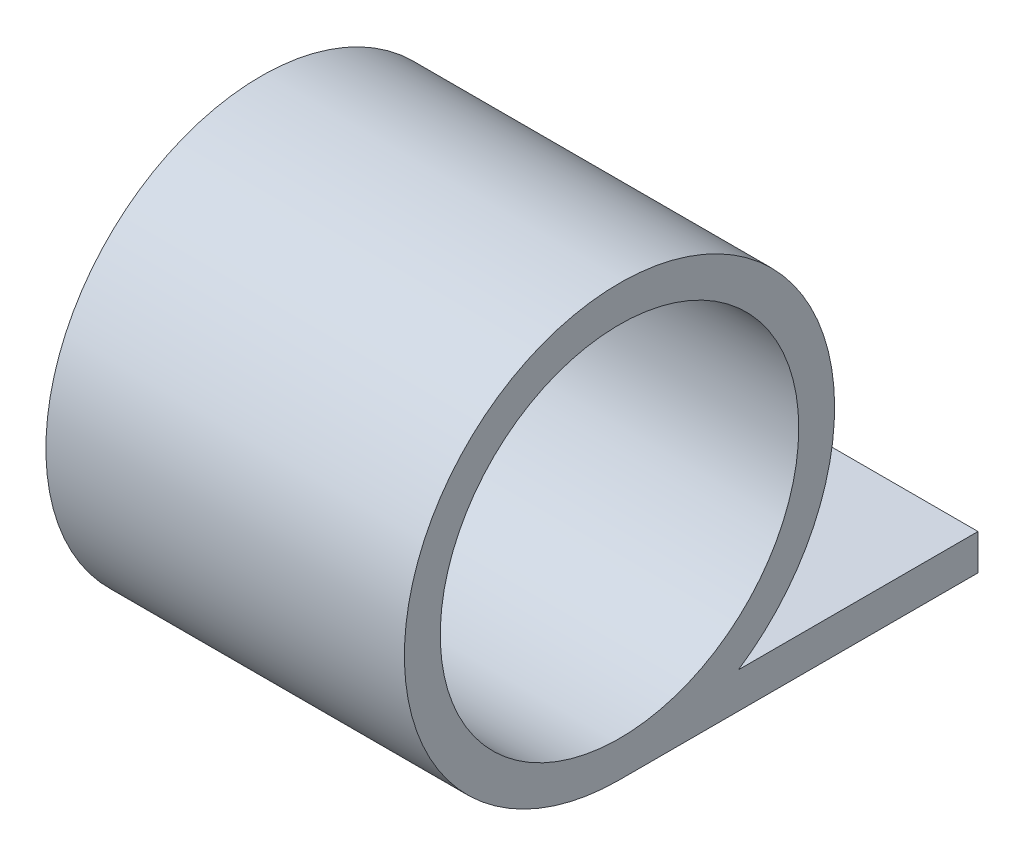
ISO-10303-21;
HEADER;
FILE_DESCRIPTION(('STEP AP214'),'2;1');
FILE_NAME('part.step','',(''),(''),'','','');
FILE_SCHEMA(('AUTOMOTIVE_DESIGN { 1 0 10303 214 1 1 1 1 }'));
ENDSEC;
DATA;
#1=APPLICATION_CONTEXT('core data for automotive mechanical design processes');
#2=APPLICATION_PROTOCOL_DEFINITION('international standard','automotive_design',2000,#1);
#3=PRODUCT_CONTEXT('',#1,'mechanical');
#4=PRODUCT('Part','Part','',(#3));
#5=PRODUCT_RELATED_PRODUCT_CATEGORY('part','',(#4));
#6=PRODUCT_DEFINITION_FORMATION('','',#4);
#7=PRODUCT_DEFINITION_CONTEXT('part definition',#1,'design');
#8=PRODUCT_DEFINITION('design','',#6,#7);
#9=PRODUCT_DEFINITION_SHAPE('','',#8);
#10=(LENGTH_UNIT() NAMED_UNIT(*) SI_UNIT(.MILLI.,.METRE.));
#11=(NAMED_UNIT(*) PLANE_ANGLE_UNIT() SI_UNIT($,.RADIAN.));
#12=(NAMED_UNIT(*) SI_UNIT($,.STERADIAN.) SOLID_ANGLE_UNIT());
#13=UNCERTAINTY_MEASURE_WITH_UNIT(LENGTH_MEASURE(1.E-05),#10,'distance_accuracy_value','');
#14=(GEOMETRIC_REPRESENTATION_CONTEXT(3) GLOBAL_UNCERTAINTY_ASSIGNED_CONTEXT((#13)) GLOBAL_UNIT_ASSIGNED_CONTEXT((#10,
#11,#12)) REPRESENTATION_CONTEXT('',''));
#15=CARTESIAN_POINT('',(0.,0.,0.));
#16=DIRECTION('',(0.,0.,1.));
#17=DIRECTION('',(1.,0.,0.));
#18=AXIS2_PLACEMENT_3D('',#15,#16,#17);
#19=CARTESIAN_POINT('',(10.,0.,0.));
#20=DIRECTION('',(1.,0.,0.));
#21=DIRECTION('',(0.,0.,-1.));
#22=AXIS2_PLACEMENT_3D('',#19,#20,#21);
#23=PLANE('',#22);
#24=CARTESIAN_POINT('',(10.,0.,0.));
#25=DIRECTION('',(1.,0.,0.));
#26=DIRECTION('',(0.,0.,-1.));
#27=AXIS2_PLACEMENT_3D('',#24,#25,#26);
#28=CIRCLE('',#27,6.);
#29=CARTESIAN_POINT('',(10.,-5.,-3.3166247903554));
#30=VERTEX_POINT('',#29);
#31=CARTESIAN_POINT('',(10.,-6.,0.));
#32=VERTEX_POINT('',#31);
#33=EDGE_CURVE('E83',#30,#32,#28,.T.);
#34=ORIENTED_EDGE('',*,*,#33,.T.);
#35=DIRECTION('',(0.,0.,-1.));
#36=VECTOR('',#35,1.);
#37=CARTESIAN_POINT('',(10.,-6.,-10.));
#38=LINE('',#37,#36);
#39=CARTESIAN_POINT('',(10.,-6.,-10.));
#40=VERTEX_POINT('',#39);
#41=EDGE_CURVE('E78',#32,#40,#38,.T.);
#42=ORIENTED_EDGE('',*,*,#41,.T.);
#43=DIRECTION('',(0.,1.,0.));
#44=VECTOR('',#43,1.);
#45=CARTESIAN_POINT('',(10.,-5.,-10.));
#46=LINE('',#45,#44);
#47=CARTESIAN_POINT('',(10.,-5.,-10.));
#48=VERTEX_POINT('',#47);
#49=EDGE_CURVE('E81',#40,#48,#46,.T.);
#50=ORIENTED_EDGE('',*,*,#49,.T.);
#51=DIRECTION('',(0.,0.,1.));
#52=VECTOR('',#51,1.);
#53=CARTESIAN_POINT('',(10.,-5.,-10.));
#54=LINE('',#53,#52);
#55=EDGE_CURVE('E48',#48,#30,#54,.T.);
#56=ORIENTED_EDGE('',*,*,#55,.T.);
#57=EDGE_LOOP('',(#34,#42,#50,#56));
#58=FACE_BOUND('',#57,.T.);
#59=CARTESIAN_POINT('',(10.,0.,0.));
#60=DIRECTION('',(1.,0.,0.));
#61=DIRECTION('',(0.,0.,-1.));
#62=AXIS2_PLACEMENT_3D('',#59,#60,#61);
#63=CIRCLE('',#62,5.);
#64=CARTESIAN_POINT('',(10.,0.,-5.));
#65=VERTEX_POINT('',#64);
#66=EDGE_CURVE('E98',#65,#65,#63,.T.);
#67=ORIENTED_EDGE('',*,*,#66,.F.);
#68=EDGE_LOOP('',(#67));
#69=FACE_BOUND('',#68,.T.);
#70=ADVANCED_FACE('F31',(#58,#69),#23,.T.);
#71=CARTESIAN_POINT('',(0.,0.,0.));
#72=DIRECTION('',(1.,0.,0.));
#73=DIRECTION('',(0.,0.,-1.));
#74=AXIS2_PLACEMENT_3D('',#71,#72,#73);
#75=PLANE('',#74);
#76=CARTESIAN_POINT('',(0.,0.,0.));
#77=DIRECTION('',(1.,0.,0.));
#78=DIRECTION('',(0.,0.,-1.));
#79=AXIS2_PLACEMENT_3D('',#76,#77,#78);
#80=CIRCLE('',#79,6.);
#81=CARTESIAN_POINT('',(0.,-5.,-3.3166247903554));
#82=VERTEX_POINT('',#81);
#83=CARTESIAN_POINT('',(0.,-6.,0.));
#84=VERTEX_POINT('',#83);
#85=EDGE_CURVE('E95',#82,#84,#80,.T.);
#86=ORIENTED_EDGE('',*,*,#85,.F.);
#87=DIRECTION('',(0.,0.,1.));
#88=VECTOR('',#87,1.);
#89=CARTESIAN_POINT('',(0.,-5.,-10.));
#90=LINE('',#89,#88);
#91=CARTESIAN_POINT('',(0.,-5.,-10.));
#92=VERTEX_POINT('',#91);
#93=EDGE_CURVE('E71',#92,#82,#90,.T.);
#94=ORIENTED_EDGE('',*,*,#93,.F.);
#95=DIRECTION('',(0.,1.,0.));
#96=VECTOR('',#95,1.);
#97=CARTESIAN_POINT('',(0.,-5.,-10.));
#98=LINE('',#97,#96);
#99=CARTESIAN_POINT('',(0.,-6.,-10.));
#100=VERTEX_POINT('',#99);
#101=EDGE_CURVE('E65',#100,#92,#98,.T.);
#102=ORIENTED_EDGE('',*,*,#101,.F.);
#103=DIRECTION('',(0.,0.,-1.));
#104=VECTOR('',#103,1.);
#105=CARTESIAN_POINT('',(0.,-6.,-10.));
#106=LINE('',#105,#104);
#107=EDGE_CURVE('E87',#84,#100,#106,.T.);
#108=ORIENTED_EDGE('',*,*,#107,.F.);
#109=EDGE_LOOP('',(#86,#94,#102,#108));
#110=FACE_BOUND('',#109,.T.);
#111=CARTESIAN_POINT('',(0.,0.,0.));
#112=DIRECTION('',(1.,0.,0.));
#113=DIRECTION('',(0.,0.,-1.));
#114=AXIS2_PLACEMENT_3D('',#111,#112,#113);
#115=CIRCLE('',#114,5.);
#116=CARTESIAN_POINT('',(0.,0.,-5.));
#117=VERTEX_POINT('',#116);
#118=EDGE_CURVE('E110',#117,#117,#115,.T.);
#119=ORIENTED_EDGE('',*,*,#118,.T.);
#120=EDGE_LOOP('',(#119));
#121=FACE_BOUND('',#120,.T.);
#122=ADVANCED_FACE('F106',(#110,#121),#75,.F.);
#123=CARTESIAN_POINT('',(10.,0.,0.));
#124=DIRECTION('',(-1.,0.,0.));
#125=DIRECTION('',(0.,0.,1.));
#126=AXIS2_PLACEMENT_3D('',#123,#124,#125);
#127=CYLINDRICAL_SURFACE('',#126,6.);
#128=ORIENTED_EDGE('',*,*,#85,.T.);
#129=DIRECTION('',(-1.,0.,0.));
#130=VECTOR('',#129,1.);
#131=CARTESIAN_POINT('',(10.,-6.,0.));
#132=LINE('',#131,#130);
#133=EDGE_CURVE('E11',#32,#84,#132,.T.);
#134=ORIENTED_EDGE('',*,*,#133,.F.);
#135=ORIENTED_EDGE('',*,*,#33,.F.);
#136=DIRECTION('',(-1.,0.,0.));
#137=VECTOR('',#136,1.);
#138=CARTESIAN_POINT('',(10.,-5.,-3.3166247903554));
#139=LINE('',#138,#137);
#140=EDGE_CURVE('E91',#30,#82,#139,.T.);
#141=ORIENTED_EDGE('',*,*,#140,.T.);
#142=EDGE_LOOP('',(#128,#134,#135,#141));
#143=FACE_BOUND('',#142,.T.);
#144=ADVANCED_FACE('F33',(#143),#127,.T.);
#145=CARTESIAN_POINT('',(10.,-6.,-10.));
#146=DIRECTION('',(0.,1.,0.));
#147=DIRECTION('',(0.,0.,1.));
#148=AXIS2_PLACEMENT_3D('',#145,#146,#147);
#149=PLANE('',#148);
#150=ORIENTED_EDGE('',*,*,#107,.T.);
#151=DIRECTION('',(-1.,0.,0.));
#152=VECTOR('',#151,1.);
#153=CARTESIAN_POINT('',(10.,-6.,-10.));
#154=LINE('',#153,#152);
#155=EDGE_CURVE('E40',#40,#100,#154,.T.);
#156=ORIENTED_EDGE('',*,*,#155,.F.);
#157=ORIENTED_EDGE('',*,*,#41,.F.);
#158=ORIENTED_EDGE('',*,*,#133,.T.);
#159=EDGE_LOOP('',(#150,#156,#157,#158));
#160=FACE_BOUND('',#159,.T.);
#161=ADVANCED_FACE('F86',(#160),#149,.F.);
#162=CARTESIAN_POINT('',(10.,-5.,-10.));
#163=DIRECTION('',(0.,0.,1.));
#164=DIRECTION('',(1.,0.,0.));
#165=AXIS2_PLACEMENT_3D('',#162,#163,#164);
#166=PLANE('',#165);
#167=ORIENTED_EDGE('',*,*,#101,.T.);
#168=DIRECTION('',(-1.,0.,0.));
#169=VECTOR('',#168,1.);
#170=CARTESIAN_POINT('',(10.,-5.,-10.));
#171=LINE('',#170,#169);
#172=EDGE_CURVE('E88',#48,#92,#171,.T.);
#173=ORIENTED_EDGE('',*,*,#172,.F.);
#174=ORIENTED_EDGE('',*,*,#49,.F.);
#175=ORIENTED_EDGE('',*,*,#155,.T.);
#176=EDGE_LOOP('',(#167,#173,#174,#175));
#177=FACE_BOUND('',#176,.T.);
#178=ADVANCED_FACE('F89',(#177),#166,.F.);
#179=CARTESIAN_POINT('',(10.,-5.,-10.));
#180=DIRECTION('',(0.,-1.,0.));
#181=DIRECTION('',(0.,0.,-1.));
#182=AXIS2_PLACEMENT_3D('',#179,#180,#181);
#183=PLANE('',#182);
#184=ORIENTED_EDGE('',*,*,#93,.T.);
#185=ORIENTED_EDGE('',*,*,#140,.F.);
#186=ORIENTED_EDGE('',*,*,#55,.F.);
#187=ORIENTED_EDGE('',*,*,#172,.T.);
#188=EDGE_LOOP('',(#184,#185,#186,#187));
#189=FACE_BOUND('',#188,.T.);
#190=ADVANCED_FACE('F103',(#189),#183,.F.);
#191=CARTESIAN_POINT('',(10.,0.,0.));
#192=DIRECTION('',(-1.,0.,0.));
#193=DIRECTION('',(0.,0.,1.));
#194=AXIS2_PLACEMENT_3D('',#191,#192,#193);
#195=CYLINDRICAL_SURFACE('',#194,5.);
#196=ORIENTED_EDGE('',*,*,#66,.T.);
#197=EDGE_LOOP('',(#196));
#198=FACE_BOUND('',#197,.T.);
#199=ORIENTED_EDGE('',*,*,#118,.F.);
#200=EDGE_LOOP('',(#199));
#201=FACE_BOUND('',#200,.T.);
#202=ADVANCED_FACE('F116',(#198,#201),#195,.F.);
#203=CLOSED_SHELL('',(#70,#122,#144,#161,#178,#190,#202));
#204=MANIFOLD_SOLID_BREP('B2',#203);
#205=ADVANCED_BREP_SHAPE_REPRESENTATION('',(#18,#204),#14);
#206=SHAPE_DEFINITION_REPRESENTATION(#9,#205);
ENDSEC;
END-ISO-10303-21;
